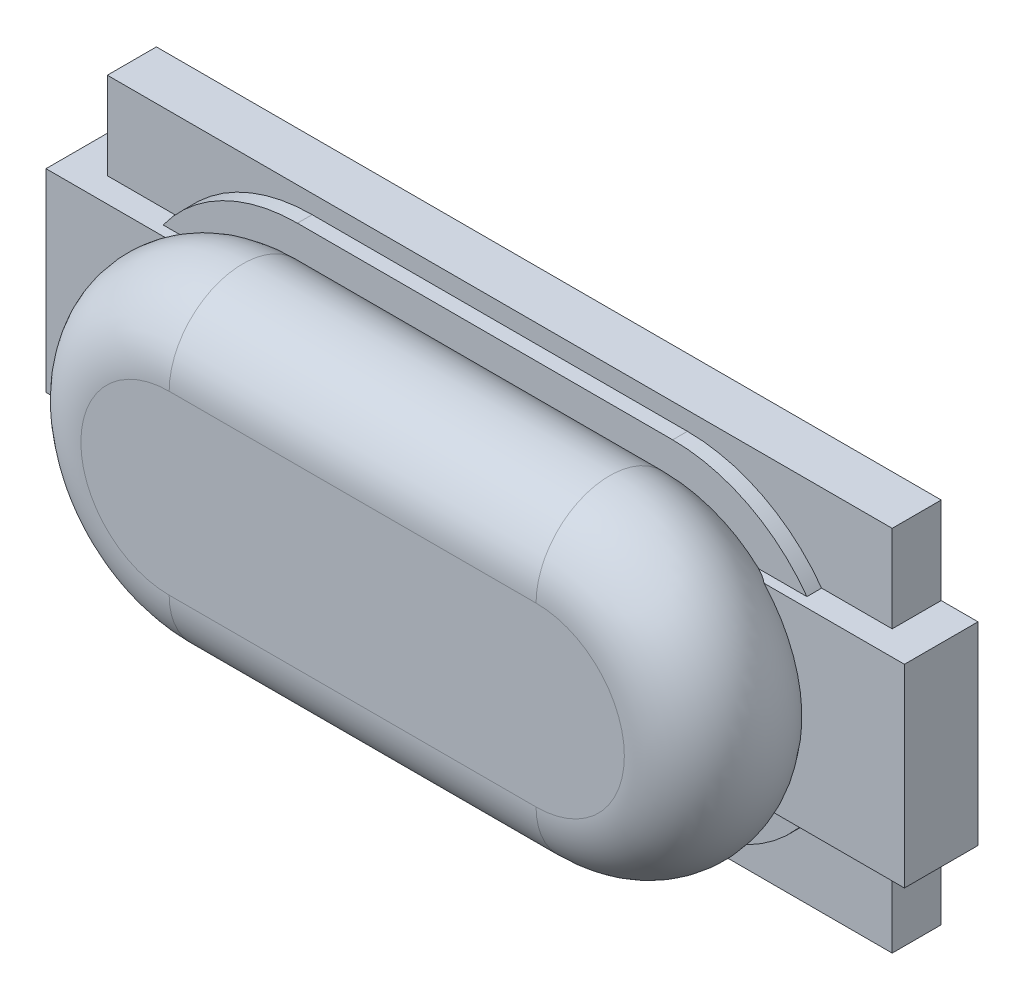
ISO-10303-21;
HEADER;
FILE_DESCRIPTION(('STEP AP214'),'2;1');
FILE_NAME('part.step','',(''),(''),'','','');
FILE_SCHEMA(('AUTOMOTIVE_DESIGN { 1 0 10303 214 1 1 1 1 }'));
ENDSEC;
DATA;
#1=APPLICATION_CONTEXT('core data for automotive mechanical design processes');
#2=APPLICATION_PROTOCOL_DEFINITION('international standard','automotive_design',2000,#1);
#3=PRODUCT_CONTEXT('',#1,'mechanical');
#4=PRODUCT('Part','Part','',(#3));
#5=PRODUCT_RELATED_PRODUCT_CATEGORY('part','',(#4));
#6=PRODUCT_DEFINITION_FORMATION('','',#4);
#7=PRODUCT_DEFINITION_CONTEXT('part definition',#1,'design');
#8=PRODUCT_DEFINITION('design','',#6,#7);
#9=PRODUCT_DEFINITION_SHAPE('','',#8);
#10=(LENGTH_UNIT() NAMED_UNIT(*) SI_UNIT(.MILLI.,.METRE.));
#11=(NAMED_UNIT(*) PLANE_ANGLE_UNIT() SI_UNIT($,.RADIAN.));
#12=(NAMED_UNIT(*) SI_UNIT($,.STERADIAN.) SOLID_ANGLE_UNIT());
#13=UNCERTAINTY_MEASURE_WITH_UNIT(LENGTH_MEASURE(1.E-05),#10,'distance_accuracy_value','');
#14=(GEOMETRIC_REPRESENTATION_CONTEXT(3) GLOBAL_UNCERTAINTY_ASSIGNED_CONTEXT((#13)) GLOBAL_UNIT_ASSIGNED_CONTEXT((#10,
#11,#12)) REPRESENTATION_CONTEXT('',''));
#15=CARTESIAN_POINT('',(0.,0.,0.));
#16=DIRECTION('',(0.,0.,1.));
#17=DIRECTION('',(1.,0.,0.));
#18=AXIS2_PLACEMENT_3D('',#15,#16,#17);
#19=CARTESIAN_POINT('',(0.,0.36,0.5));
#20=DIRECTION('',(-1.,0.,0.));
#21=DIRECTION('',(0.,0.,1.));
#22=AXIS2_PLACEMENT_3D('',#19,#20,#21);
#23=CYLINDRICAL_SURFACE('',#22,0.3);
#24=DIRECTION('',(1.,0.,0.));
#25=VECTOR('',#24,1.);
#26=CARTESIAN_POINT('',(-0.748,0.36,0.8));
#27=LINE('',#26,#25);
#28=CARTESIAN_POINT('',(0.748,0.36,0.8));
#29=VERTEX_POINT('',#28);
#30=CARTESIAN_POINT('',(-0.748,0.36,0.8));
#31=VERTEX_POINT('',#30);
#32=EDGE_CURVE('E333',#29,#31,#27,.F.);
#33=ORIENTED_EDGE('',*,*,#32,.F.);
#34=CARTESIAN_POINT('',(0.748,0.36,0.5));
#35=DIRECTION('',(-1.,0.,0.));
#36=DIRECTION('',(0.,0.,1.));
#37=AXIS2_PLACEMENT_3D('',#34,#35,#36);
#38=CIRCLE('',#37,0.3);
#39=CARTESIAN_POINT('',(0.748,0.54,0.26));
#40=VERTEX_POINT('',#39);
#41=EDGE_CURVE('E198',#29,#40,#38,.T.);
#42=ORIENTED_EDGE('',*,*,#41,.T.);
#43=DIRECTION('',(1.,0.,0.));
#44=VECTOR('',#43,1.);
#45=CARTESIAN_POINT('',(-0.765,0.54,0.26));
#46=LINE('',#45,#44);
#47=CARTESIAN_POINT('',(-0.748,0.54,0.26));
#48=VERTEX_POINT('',#47);
#49=EDGE_CURVE('E229',#48,#40,#46,.T.);
#50=ORIENTED_EDGE('',*,*,#49,.F.);
#51=CARTESIAN_POINT('',(-0.748,0.36,0.5));
#52=DIRECTION('',(-1.,0.,0.));
#53=DIRECTION('',(0.,0.,1.));
#54=AXIS2_PLACEMENT_3D('',#51,#52,#53);
#55=CIRCLE('',#54,0.3);
#56=EDGE_CURVE('E655',#48,#31,#55,.F.);
#57=ORIENTED_EDGE('',*,*,#56,.T.);
#58=EDGE_LOOP('',(#33,#42,#50,#57));
#59=FACE_BOUND('',#58,.T.);
#60=ADVANCED_FACE('F16',(#59),#23,.T.);
#61=CARTESIAN_POINT('',(-0.748,-0.36,0.5));
#62=DIRECTION('',(1.,0.,0.));
#63=DIRECTION('',(0.,0.,-1.));
#64=AXIS2_PLACEMENT_3D('',#61,#62,#63);
#65=CYLINDRICAL_SURFACE('',#64,0.3);
#66=DIRECTION('',(1.,0.,0.));
#67=VECTOR('',#66,1.);
#68=CARTESIAN_POINT('',(-0.748,-0.36,0.8));
#69=LINE('',#68,#67);
#70=CARTESIAN_POINT('',(-0.748,-0.36,0.8));
#71=VERTEX_POINT('',#70);
#72=CARTESIAN_POINT('',(0.748,-0.36,0.8));
#73=VERTEX_POINT('',#72);
#74=EDGE_CURVE('E304',#71,#73,#69,.T.);
#75=ORIENTED_EDGE('',*,*,#74,.F.);
#76=CARTESIAN_POINT('',(-0.748,-0.36,0.5));
#77=DIRECTION('',(1.,0.,0.));
#78=DIRECTION('',(0.,0.,-1.));
#79=AXIS2_PLACEMENT_3D('',#76,#77,#78);
#80=CIRCLE('',#79,0.3);
#81=CARTESIAN_POINT('',(-0.748,-0.54,0.26));
#82=VERTEX_POINT('',#81);
#83=EDGE_CURVE('E232',#71,#82,#80,.T.);
#84=ORIENTED_EDGE('',*,*,#83,.T.);
#85=DIRECTION('',(1.,0.,0.));
#86=VECTOR('',#85,1.);
#87=CARTESIAN_POINT('',(-0.765,-0.54,0.26));
#88=LINE('',#87,#86);
#89=CARTESIAN_POINT('',(0.748,-0.54,0.26));
#90=VERTEX_POINT('',#89);
#91=EDGE_CURVE('E294',#90,#82,#88,.F.);
#92=ORIENTED_EDGE('',*,*,#91,.F.);
#93=CARTESIAN_POINT('',(0.748,-0.36,0.5));
#94=DIRECTION('',(1.,0.,0.));
#95=DIRECTION('',(0.,0.,-1.));
#96=AXIS2_PLACEMENT_3D('',#93,#94,#95);
#97=CIRCLE('',#96,0.3);
#98=EDGE_CURVE('E245',#90,#73,#97,.F.);
#99=ORIENTED_EDGE('',*,*,#98,.T.);
#100=EDGE_LOOP('',(#75,#84,#92,#99));
#101=FACE_BOUND('',#100,.T.);
#102=ADVANCED_FACE('F665',(#101),#65,.T.);
#103=CARTESIAN_POINT('',(-0.765,-0.675,0.26));
#104=DIRECTION('',(0.,0.,1.));
#105=DIRECTION('',(1.,0.,0.));
#106=AXIS2_PLACEMENT_3D('',#103,#104,#105);
#107=PLANE('',#106);
#108=DIRECTION('',(1.,0.,0.));
#109=VECTOR('',#108,1.);
#110=CARTESIAN_POINT('',(0.765,0.675,0.26));
#111=LINE('',#110,#109);
#112=CARTESIAN_POINT('',(-0.765,0.675,0.26));
#113=VERTEX_POINT('',#112);
#114=CARTESIAN_POINT('',(0.765,0.675,0.26));
#115=VERTEX_POINT('',#114);
#116=EDGE_CURVE('E345',#113,#115,#111,.T.);
#117=ORIENTED_EDGE('',*,*,#116,.F.);
#118=CARTESIAN_POINT('',(-0.765,0.,0.26));
#119=DIRECTION('',(0.,0.,1.));
#120=DIRECTION('',(1.,0.,0.));
#121=AXIS2_PLACEMENT_3D('',#118,#119,#120);
#122=CIRCLE('',#121,0.675);
#123=CARTESIAN_POINT('',(-1.31235728733616,0.395,0.26));
#124=VERTEX_POINT('',#123);
#125=EDGE_CURVE('E411',#124,#113,#122,.F.);
#126=ORIENTED_EDGE('',*,*,#125,.F.);
#127=DIRECTION('',(1.,0.,0.));
#128=VECTOR('',#127,1.);
#129=CARTESIAN_POINT('',(-0.765,0.395,0.26));
#130=LINE('',#129,#128);
#131=CARTESIAN_POINT('',(-1.11620510588529,0.395,0.26));
#132=VERTEX_POINT('',#131);
#133=EDGE_CURVE('E230',#124,#132,#130,.T.);
#134=ORIENTED_EDGE('',*,*,#133,.T.);
#135=CARTESIAN_POINT('',(-0.748,0.,0.26));
#136=DIRECTION('',(0.,0.,1.));
#137=DIRECTION('',(1.,0.,0.));
#138=AXIS2_PLACEMENT_3D('',#135,#136,#137);
#139=CIRCLE('',#138,0.54);
#140=EDGE_CURVE('E437',#48,#132,#139,.T.);
#141=ORIENTED_EDGE('',*,*,#140,.F.);
#142=ORIENTED_EDGE('',*,*,#49,.T.);
#143=CARTESIAN_POINT('',(0.748,0.,0.26));
#144=DIRECTION('',(0.,0.,1.));
#145=DIRECTION('',(1.,0.,0.));
#146=AXIS2_PLACEMENT_3D('',#143,#144,#145);
#147=CIRCLE('',#146,0.54);
#148=CARTESIAN_POINT('',(1.11620510588529,0.395,0.26));
#149=VERTEX_POINT('',#148);
#150=EDGE_CURVE('E19',#40,#149,#147,.F.);
#151=ORIENTED_EDGE('',*,*,#150,.T.);
#152=DIRECTION('',(1.,0.,0.));
#153=VECTOR('',#152,1.);
#154=CARTESIAN_POINT('',(-0.765,0.395,0.26));
#155=LINE('',#154,#153);
#156=CARTESIAN_POINT('',(1.31235728733616,0.395,0.26));
#157=VERTEX_POINT('',#156);
#158=EDGE_CURVE('E205',#149,#157,#155,.T.);
#159=ORIENTED_EDGE('',*,*,#158,.T.);
#160=CARTESIAN_POINT('',(0.765,0.,0.26));
#161=DIRECTION('',(0.,0.,1.));
#162=DIRECTION('',(1.,0.,0.));
#163=AXIS2_PLACEMENT_3D('',#160,#161,#162);
#164=CIRCLE('',#163,0.675);
#165=EDGE_CURVE('E215',#157,#115,#164,.T.);
#166=ORIENTED_EDGE('',*,*,#165,.T.);
#167=EDGE_LOOP('',(#117,#126,#134,#141,#142,#151,#159,#166));
#168=FACE_BOUND('',#167,.T.);
#169=ADVANCED_FACE('F227',(#168),#107,.T.);
#170=CARTESIAN_POINT('',(-0.748,-0.66,0.8));
#171=DIRECTION('',(0.,0.,1.));
#172=DIRECTION('',(1.,0.,0.));
#173=AXIS2_PLACEMENT_3D('',#170,#171,#172);
#174=PLANE('',#173);
#175=ORIENTED_EDGE('',*,*,#74,.T.);
#176=CARTESIAN_POINT('',(0.748,0.,0.8));
#177=DIRECTION('',(0.,0.,-1.));
#178=DIRECTION('',(0.,1.,0.));
#179=AXIS2_PLACEMENT_3D('',#176,#177,#178);
#180=CIRCLE('',#179,0.36);
#181=EDGE_CURVE('E341',#29,#73,#180,.T.);
#182=ORIENTED_EDGE('',*,*,#181,.F.);
#183=ORIENTED_EDGE('',*,*,#32,.T.);
#184=CARTESIAN_POINT('',(-0.748,0.,0.8));
#185=DIRECTION('',(0.,0.,-1.));
#186=DIRECTION('',(0.,-1.,0.));
#187=AXIS2_PLACEMENT_3D('',#184,#185,#186);
#188=CIRCLE('',#187,0.36);
#189=EDGE_CURVE('E240',#71,#31,#188,.T.);
#190=ORIENTED_EDGE('',*,*,#189,.F.);
#191=EDGE_LOOP('',(#175,#182,#183,#190));
#192=FACE_BOUND('',#191,.T.);
#193=ADVANCED_FACE('F314',(#192),#174,.T.);
#194=CARTESIAN_POINT('',(-0.765,-0.675,0.26));
#195=DIRECTION('',(0.,0.,1.));
#196=DIRECTION('',(1.,0.,0.));
#197=AXIS2_PLACEMENT_3D('',#194,#195,#196);
#198=PLANE('',#197);
#199=ORIENTED_EDGE('',*,*,#91,.T.);
#200=CARTESIAN_POINT('',(-0.748,0.,0.26));
#201=DIRECTION('',(0.,0.,1.));
#202=DIRECTION('',(1.,0.,0.));
#203=AXIS2_PLACEMENT_3D('',#200,#201,#202);
#204=CIRCLE('',#203,0.54);
#205=CARTESIAN_POINT('',(-1.11620510588529,-0.395,0.26));
#206=VERTEX_POINT('',#205);
#207=EDGE_CURVE('E297',#206,#82,#204,.T.);
#208=ORIENTED_EDGE('',*,*,#207,.F.);
#209=DIRECTION('',(1.,0.,0.));
#210=VECTOR('',#209,1.);
#211=CARTESIAN_POINT('',(-0.765,-0.395,0.26));
#212=LINE('',#211,#210);
#213=CARTESIAN_POINT('',(-1.31235728733616,-0.395,0.26));
#214=VERTEX_POINT('',#213);
#215=EDGE_CURVE('E301',#206,#214,#212,.F.);
#216=ORIENTED_EDGE('',*,*,#215,.T.);
#217=CARTESIAN_POINT('',(-0.765,0.,0.26));
#218=DIRECTION('',(0.,0.,1.));
#219=DIRECTION('',(1.,0.,0.));
#220=AXIS2_PLACEMENT_3D('',#217,#218,#219);
#221=CIRCLE('',#220,0.675);
#222=CARTESIAN_POINT('',(-0.765,-0.675,0.26));
#223=VERTEX_POINT('',#222);
#224=EDGE_CURVE('E300',#214,#223,#221,.T.);
#225=ORIENTED_EDGE('',*,*,#224,.T.);
#226=DIRECTION('',(1.,0.,0.));
#227=VECTOR('',#226,1.);
#228=CARTESIAN_POINT('',(-0.765,-0.675,0.26));
#229=LINE('',#228,#227);
#230=CARTESIAN_POINT('',(0.765,-0.675,0.26));
#231=VERTEX_POINT('',#230);
#232=EDGE_CURVE('E289',#231,#223,#229,.F.);
#233=ORIENTED_EDGE('',*,*,#232,.F.);
#234=CARTESIAN_POINT('',(0.765,0.,0.26));
#235=DIRECTION('',(0.,0.,1.));
#236=DIRECTION('',(1.,0.,0.));
#237=AXIS2_PLACEMENT_3D('',#234,#235,#236);
#238=CIRCLE('',#237,0.675);
#239=CARTESIAN_POINT('',(1.31235728733616,-0.395,0.26));
#240=VERTEX_POINT('',#239);
#241=EDGE_CURVE('E489',#240,#231,#238,.F.);
#242=ORIENTED_EDGE('',*,*,#241,.F.);
#243=DIRECTION('',(1.,0.,0.));
#244=VECTOR('',#243,1.);
#245=CARTESIAN_POINT('',(-0.765,-0.395,0.26));
#246=LINE('',#245,#244);
#247=CARTESIAN_POINT('',(1.11620510588529,-0.395,0.26));
#248=VERTEX_POINT('',#247);
#249=EDGE_CURVE('E298',#240,#248,#246,.F.);
#250=ORIENTED_EDGE('',*,*,#249,.T.);
#251=CARTESIAN_POINT('',(0.748,0.,0.26));
#252=DIRECTION('',(0.,0.,1.));
#253=DIRECTION('',(1.,0.,0.));
#254=AXIS2_PLACEMENT_3D('',#251,#252,#253);
#255=CIRCLE('',#254,0.54);
#256=EDGE_CURVE('E636',#90,#248,#255,.T.);
#257=ORIENTED_EDGE('',*,*,#256,.F.);
#258=EDGE_LOOP('',(#199,#208,#216,#225,#233,#242,#250,#257));
#259=FACE_BOUND('',#258,.T.);
#260=ADVANCED_FACE('F259',(#259),#198,.T.);
#261=CARTESIAN_POINT('',(-0.748,0.,0.5));
#262=DIRECTION('',(0.,0.,1.));
#263=DIRECTION('',(-1.,0.,0.));
#264=AXIS2_PLACEMENT_3D('',#261,#262,#263);
#265=TOROIDAL_SURFACE('',#264,0.36,0.3);
#266=ORIENTED_EDGE('',*,*,#56,.F.);
#267=ORIENTED_EDGE('',*,*,#140,.T.);
#268=CARTESIAN_POINT('',(-1.17773975167522,0.395,0.3001));
#269=CARTESIAN_POINT('',(-1.17299925239635,0.395,0.296194068107284));
#270=CARTESIAN_POINT('',(-1.16814360275164,0.395,0.292429365508522));
#271=CARTESIAN_POINT('',(-1.15824113131823,0.395,0.285191667015459));
#272=CARTESIAN_POINT('',(-1.15319490914168,0.395,0.281717851451327));
#273=CARTESIAN_POINT('',(-1.14292280202309,0.395,0.275048612592429));
#274=CARTESIAN_POINT('',(-1.13769692948187,0.395,0.271853170135846));
#275=CARTESIAN_POINT('',(-1.12707203991182,0.395,0.265726365794871));
#276=CARTESIAN_POINT('',(-1.12167256058991,0.395,0.262795804788212));
#277=CARTESIAN_POINT('',(-1.11620510588529,0.395,0.259999999999999));
#278=B_SPLINE_CURVE_WITH_KNOTS('',3,(#268,#269,#270,#271,#272,#273,#274,#275,#276,#277),
.UNSPECIFIED.,.F.,.F.,(4,2,2,2,4),(0.,0.0184230566428002,0.0367923189429483,0.0551603157938781,
0.0735821106827577),.UNSPECIFIED.);
#279=CARTESIAN_POINT('',(-1.17773975167522,0.395,0.3001));
#280=VERTEX_POINT('',#279);
#281=EDGE_CURVE('E413',#280,#132,#278,.T.);
#282=ORIENTED_EDGE('',*,*,#281,.F.);
#283=CARTESIAN_POINT('',(-0.748,0.,0.3001));
#284=DIRECTION('',(0.,0.,1.));
#285=DIRECTION('',(1.,0.,0.));
#286=AXIS2_PLACEMENT_3D('',#283,#284,#285);
#287=CIRCLE('',#286,0.583696200235945);
#288=CARTESIAN_POINT('',(-1.17773975167522,-0.395,0.3001));
#289=VERTEX_POINT('',#288);
#290=EDGE_CURVE('E431',#289,#280,#287,.F.);
#291=ORIENTED_EDGE('',*,*,#290,.F.);
#292=CARTESIAN_POINT('',(-1.11620510588529,-0.395,0.259999999999999));
#293=CARTESIAN_POINT('',(-1.12167256058991,-0.395,0.262795804788212));
#294=CARTESIAN_POINT('',(-1.12707203991181,-0.395,0.265726365794871));
#295=CARTESIAN_POINT('',(-1.13769692948187,-0.395,0.271853170135846));
#296=CARTESIAN_POINT('',(-1.14292280202309,-0.395,0.275048612592429));
#297=CARTESIAN_POINT('',(-1.15319490914168,-0.395,0.281717851451327));
#298=CARTESIAN_POINT('',(-1.15824113131823,-0.395,0.285191667015459));
#299=CARTESIAN_POINT('',(-1.16814360275164,-0.395,0.292429365508522));
#300=CARTESIAN_POINT('',(-1.17299925239635,-0.395,0.296194068107284));
#301=CARTESIAN_POINT('',(-1.17773975167522,-0.395,0.3001));
#302=B_SPLINE_CURVE_WITH_KNOTS('',3,(#292,#293,#294,#295,#296,#297,#298,#299,#300,#301),
.UNSPECIFIED.,.F.,.F.,(4,2,2,2,4),(0.,0.0184217948888799,0.0367897917398098,0.055159054039958,
0.0735821106827585),.UNSPECIFIED.);
#303=EDGE_CURVE('E479',#206,#289,#302,.T.);
#304=ORIENTED_EDGE('',*,*,#303,.F.);
#305=ORIENTED_EDGE('',*,*,#207,.T.);
#306=ORIENTED_EDGE('',*,*,#83,.F.);
#307=ORIENTED_EDGE('',*,*,#189,.T.);
#308=EDGE_LOOP('',(#266,#267,#282,#291,#304,#305,#306,#307));
#309=FACE_BOUND('',#308,.T.);
#310=ADVANCED_FACE('F247',(#309),#265,.T.);
#311=CARTESIAN_POINT('',(0.25,-0.395,0.3001));
#312=DIRECTION('',(0.,0.,1.));
#313=DIRECTION('',(1.,0.,0.));
#314=AXIS2_PLACEMENT_3D('',#311,#312,#313);
#315=PLANE('',#314);
#316=DIRECTION('',(0.,1.,0.));
#317=VECTOR('',#316,1.);
#318=CARTESIAN_POINT('',(-1.75,0.395,0.3001));
#319=LINE('',#318,#317);
#320=CARTESIAN_POINT('',(-1.75,-0.395,0.3001));
#321=VERTEX_POINT('',#320);
#322=CARTESIAN_POINT('',(-1.75,0.395,0.3001));
#323=VERTEX_POINT('',#322);
#324=EDGE_CURVE('E430',#321,#323,#319,.T.);
#325=ORIENTED_EDGE('',*,*,#324,.F.);
#326=DIRECTION('',(1.,0.,0.));
#327=VECTOR('',#326,1.);
#328=CARTESIAN_POINT('',(-1.75,-0.395,0.3001));
#329=LINE('',#328,#327);
#330=EDGE_CURVE('E428',#289,#321,#329,.F.);
#331=ORIENTED_EDGE('',*,*,#330,.F.);
#332=ORIENTED_EDGE('',*,*,#290,.T.);
#333=DIRECTION('',(1.,0.,0.));
#334=VECTOR('',#333,1.);
#335=CARTESIAN_POINT('',(0.25,0.395,0.3001));
#336=LINE('',#335,#334);
#337=EDGE_CURVE('E273',#323,#280,#336,.T.);
#338=ORIENTED_EDGE('',*,*,#337,.F.);
#339=EDGE_LOOP('',(#325,#331,#332,#338));
#340=FACE_BOUND('',#339,.T.);
#341=ADVANCED_FACE('F258',(#340),#315,.T.);
#342=CARTESIAN_POINT('',(-1.75,0.395,0.000100000000000031));
#343=DIRECTION('',(-1.,0.,0.));
#344=DIRECTION('',(0.,0.,1.));
#345=AXIS2_PLACEMENT_3D('',#342,#343,#344);
#346=PLANE('',#345);
#347=ORIENTED_EDGE('',*,*,#324,.T.);
#348=DIRECTION('',(0.,0.,1.));
#349=VECTOR('',#348,1.);
#350=CARTESIAN_POINT('',(-1.75,0.395,0.000100000000000031));
#351=LINE('',#350,#349);
#352=CARTESIAN_POINT('',(-1.75,0.395,0.000100000000000031));
#353=VERTEX_POINT('',#352);
#354=EDGE_CURVE('E270',#353,#323,#351,.T.);
#355=ORIENTED_EDGE('',*,*,#354,.F.);
#356=DIRECTION('',(0.,1.,0.));
#357=VECTOR('',#356,1.);
#358=CARTESIAN_POINT('',(-1.75,-0.395,0.000100000000000031));
#359=LINE('',#358,#357);
#360=CARTESIAN_POINT('',(-1.75,-0.395,0.000100000000000031));
#361=VERTEX_POINT('',#360);
#362=EDGE_CURVE('E281',#361,#353,#359,.T.);
#363=ORIENTED_EDGE('',*,*,#362,.F.);
#364=DIRECTION('',(0.,0.,-1.));
#365=VECTOR('',#364,1.);
#366=CARTESIAN_POINT('',(-1.75,-0.395,0.000100000000000031));
#367=LINE('',#366,#365);
#368=EDGE_CURVE('E425',#321,#361,#367,.T.);
#369=ORIENTED_EDGE('',*,*,#368,.F.);
#370=EDGE_LOOP('',(#347,#355,#363,#369));
#371=FACE_BOUND('',#370,.T.);
#372=ADVANCED_FACE('F669',(#371),#346,.T.);
#373=CARTESIAN_POINT('',(-0.765,0.,0.2));
#374=DIRECTION('',(0.,0.,1.));
#375=DIRECTION('',(1.,0.,0.));
#376=AXIS2_PLACEMENT_3D('',#373,#374,#375);
#377=CYLINDRICAL_SURFACE('',#376,0.675);
#378=DIRECTION('',(0.,0.,1.));
#379=VECTOR('',#378,1.);
#380=CARTESIAN_POINT('',(-0.765,0.675,0.2));
#381=LINE('',#380,#379);
#382=CARTESIAN_POINT('',(-0.765,0.675,0.2));
#383=VERTEX_POINT('',#382);
#384=EDGE_CURVE('E408',#383,#113,#381,.T.);
#385=ORIENTED_EDGE('',*,*,#384,.F.);
#386=CARTESIAN_POINT('',(-0.765,0.,0.2));
#387=DIRECTION('',(0.,0.,1.));
#388=DIRECTION('',(1.,0.,0.));
#389=AXIS2_PLACEMENT_3D('',#386,#387,#388);
#390=CIRCLE('',#389,0.675);
#391=CARTESIAN_POINT('',(-1.31235728733616,0.395,0.2));
#392=VERTEX_POINT('',#391);
#393=EDGE_CURVE('E465',#392,#383,#390,.F.);
#394=ORIENTED_EDGE('',*,*,#393,.F.);
#395=DIRECTION('',(0.,0.,1.));
#396=VECTOR('',#395,1.);
#397=CARTESIAN_POINT('',(-1.31235728733616,0.395,0.000100000000000031));
#398=LINE('',#397,#396);
#399=EDGE_CURVE('E274',#124,#392,#398,.F.);
#400=ORIENTED_EDGE('',*,*,#399,.F.);
#401=ORIENTED_EDGE('',*,*,#125,.T.);
#402=EDGE_LOOP('',(#385,#394,#400,#401));
#403=FACE_BOUND('',#402,.T.);
#404=ADVANCED_FACE('F690',(#403),#377,.T.);
#405=CARTESIAN_POINT('',(0.765,0.675,0.2));
#406=DIRECTION('',(0.,1.,0.));
#407=DIRECTION('',(0.,0.,1.));
#408=AXIS2_PLACEMENT_3D('',#405,#406,#407);
#409=PLANE('',#408);
#410=ORIENTED_EDGE('',*,*,#116,.T.);
#411=DIRECTION('',(0.,0.,1.));
#412=VECTOR('',#411,1.);
#413=CARTESIAN_POINT('',(0.765,0.675,0.2));
#414=LINE('',#413,#412);
#415=CARTESIAN_POINT('',(0.765,0.675,0.2));
#416=VERTEX_POINT('',#415);
#417=EDGE_CURVE('E405',#416,#115,#414,.T.);
#418=ORIENTED_EDGE('',*,*,#417,.F.);
#419=DIRECTION('',(1.,0.,0.));
#420=VECTOR('',#419,1.);
#421=CARTESIAN_POINT('',(-1.6,0.675,0.2));
#422=LINE('',#421,#420);
#423=EDGE_CURVE('E458',#383,#416,#422,.T.);
#424=ORIENTED_EDGE('',*,*,#423,.F.);
#425=ORIENTED_EDGE('',*,*,#384,.T.);
#426=EDGE_LOOP('',(#410,#418,#424,#425));
#427=FACE_BOUND('',#426,.T.);
#428=ADVANCED_FACE('F452',(#427),#409,.T.);
#429=CARTESIAN_POINT('',(0.765,0.,0.2));
#430=DIRECTION('',(0.,0.,1.));
#431=DIRECTION('',(1.,0.,0.));
#432=AXIS2_PLACEMENT_3D('',#429,#430,#431);
#433=CYLINDRICAL_SURFACE('',#432,0.675);
#434=ORIENTED_EDGE('',*,*,#417,.T.);
#435=ORIENTED_EDGE('',*,*,#165,.F.);
#436=DIRECTION('',(0.,0.,1.));
#437=VECTOR('',#436,1.);
#438=CARTESIAN_POINT('',(1.31235728733616,0.395,0.000100000000000031));
#439=LINE('',#438,#437);
#440=CARTESIAN_POINT('',(1.31235728733616,0.395,0.2));
#441=VERTEX_POINT('',#440);
#442=EDGE_CURVE('E212',#441,#157,#439,.T.);
#443=ORIENTED_EDGE('',*,*,#442,.F.);
#444=CARTESIAN_POINT('',(0.765,0.,0.2));
#445=DIRECTION('',(0.,0.,1.));
#446=DIRECTION('',(1.,0.,0.));
#447=AXIS2_PLACEMENT_3D('',#444,#445,#446);
#448=CIRCLE('',#447,0.675);
#449=EDGE_CURVE('E391',#416,#441,#448,.F.);
#450=ORIENTED_EDGE('',*,*,#449,.F.);
#451=EDGE_LOOP('',(#434,#435,#443,#450));
#452=FACE_BOUND('',#451,.T.);
#453=ADVANCED_FACE('F357',(#452),#433,.T.);
#454=CARTESIAN_POINT('',(0.748,0.,0.5));
#455=DIRECTION('',(0.,0.,1.));
#456=DIRECTION('',(1.,0.,0.));
#457=AXIS2_PLACEMENT_3D('',#454,#455,#456);
#458=TOROIDAL_SURFACE('',#457,0.36,0.3);
#459=CARTESIAN_POINT('',(1.17773975167522,-0.395,0.3001));
#460=CARTESIAN_POINT('',(1.17299925239635,-0.395,0.296194068107284));
#461=CARTESIAN_POINT('',(1.16814360275165,-0.395,0.292429365508522));
#462=CARTESIAN_POINT('',(1.15824113131823,-0.395,0.285191667015459));
#463=CARTESIAN_POINT('',(1.15319490914168,-0.395,0.281717851451327));
#464=CARTESIAN_POINT('',(1.14292280202309,-0.395,0.275048612592429));
#465=CARTESIAN_POINT('',(1.13769692948187,-0.395,0.271853170135846));
#466=CARTESIAN_POINT('',(1.12707203991182,-0.395,0.265726365794871));
#467=CARTESIAN_POINT('',(1.12167256058991,-0.395,0.262795804788212));
#468=CARTESIAN_POINT('',(1.11620510588529,-0.395,0.259999999999999));
#469=B_SPLINE_CURVE_WITH_KNOTS('',3,(#459,#460,#461,#462,#463,#464,#465,#466,#467,#468),
.UNSPECIFIED.,.F.,.F.,(4,2,2,2,4),(0.,0.0184230566428005,0.0367923189429486,0.0551603157938784,
0.073582110682758),.UNSPECIFIED.);
#470=CARTESIAN_POINT('',(1.17773975167522,-0.395,0.3001));
#471=VERTEX_POINT('',#470);
#472=EDGE_CURVE('E493',#471,#248,#469,.T.);
#473=ORIENTED_EDGE('',*,*,#472,.F.);
#474=CARTESIAN_POINT('',(0.748,0.,0.3001));
#475=DIRECTION('',(0.,0.,1.));
#476=DIRECTION('',(1.,0.,0.));
#477=AXIS2_PLACEMENT_3D('',#474,#475,#476);
#478=CIRCLE('',#477,0.583696200235945);
#479=CARTESIAN_POINT('',(1.17773975167522,0.395,0.3001));
#480=VERTEX_POINT('',#479);
#481=EDGE_CURVE('E221',#480,#471,#478,.F.);
#482=ORIENTED_EDGE('',*,*,#481,.F.);
#483=CARTESIAN_POINT('',(1.11620510588529,0.395,0.259999999999999));
#484=CARTESIAN_POINT('',(1.12167256058991,0.395,0.262795804788212));
#485=CARTESIAN_POINT('',(1.12707203991182,0.395,0.265726365794871));
#486=CARTESIAN_POINT('',(1.13769692948187,0.395,0.271853170135846));
#487=CARTESIAN_POINT('',(1.14292280202309,0.395,0.275048612592429));
#488=CARTESIAN_POINT('',(1.15319490914168,0.395,0.281717851451327));
#489=CARTESIAN_POINT('',(1.15824113131823,0.395,0.285191667015459));
#490=CARTESIAN_POINT('',(1.16814360275164,0.395,0.292429365508523));
#491=CARTESIAN_POINT('',(1.17299925239635,0.395,0.296194068107284));
#492=CARTESIAN_POINT('',(1.17773975167522,0.395,0.3001));
#493=B_SPLINE_CURVE_WITH_KNOTS('',3,(#483,#484,#485,#486,#487,#488,#489,#490,#491,#492),
.UNSPECIFIED.,.F.,.F.,(4,2,2,2,4),(0.,0.0184217948888798,0.0367897917398096,0.0551590540399575,
0.0735821106827578),.UNSPECIFIED.);
#494=EDGE_CURVE('E209',#149,#480,#493,.T.);
#495=ORIENTED_EDGE('',*,*,#494,.F.);
#496=ORIENTED_EDGE('',*,*,#150,.F.);
#497=ORIENTED_EDGE('',*,*,#41,.F.);
#498=ORIENTED_EDGE('',*,*,#181,.T.);
#499=ORIENTED_EDGE('',*,*,#98,.F.);
#500=ORIENTED_EDGE('',*,*,#256,.T.);
#501=EDGE_LOOP('',(#473,#482,#495,#496,#497,#498,#499,#500));
#502=FACE_BOUND('',#501,.T.);
#503=ADVANCED_FACE('F218',(#502),#458,.T.);
#504=CARTESIAN_POINT('',(1.75,-0.395,0.000100000000000031));
#505=DIRECTION('',(1.,0.,0.));
#506=DIRECTION('',(0.,0.,-1.));
#507=AXIS2_PLACEMENT_3D('',#504,#505,#506);
#508=PLANE('',#507);
#509=DIRECTION('',(0.,1.,0.));
#510=VECTOR('',#509,1.);
#511=CARTESIAN_POINT('',(1.75,-0.395,0.3001));
#512=LINE('',#511,#510);
#513=CARTESIAN_POINT('',(1.75,-0.395,0.3001));
#514=VERTEX_POINT('',#513);
#515=CARTESIAN_POINT('',(1.75,0.395,0.3001));
#516=VERTEX_POINT('',#515);
#517=EDGE_CURVE('E514',#514,#516,#512,.T.);
#518=ORIENTED_EDGE('',*,*,#517,.F.);
#519=DIRECTION('',(0.,0.,-1.));
#520=VECTOR('',#519,1.);
#521=CARTESIAN_POINT('',(1.75,-0.395,0.000100000000000031));
#522=LINE('',#521,#520);
#523=CARTESIAN_POINT('',(1.75,-0.395,0.000100000000000031));
#524=VERTEX_POINT('',#523);
#525=EDGE_CURVE('E518',#524,#514,#522,.F.);
#526=ORIENTED_EDGE('',*,*,#525,.F.);
#527=DIRECTION('',(0.,1.,0.));
#528=VECTOR('',#527,1.);
#529=CARTESIAN_POINT('',(1.75,-0.395,0.000100000000000031));
#530=LINE('',#529,#528);
#531=CARTESIAN_POINT('',(1.75,0.395,0.000100000000000031));
#532=VERTEX_POINT('',#531);
#533=EDGE_CURVE('E371',#532,#524,#530,.F.);
#534=ORIENTED_EDGE('',*,*,#533,.F.);
#535=DIRECTION('',(0.,0.,1.));
#536=VECTOR('',#535,1.);
#537=CARTESIAN_POINT('',(1.75,0.395,0.000100000000000031));
#538=LINE('',#537,#536);
#539=EDGE_CURVE('E374',#516,#532,#538,.F.);
#540=ORIENTED_EDGE('',*,*,#539,.F.);
#541=EDGE_LOOP('',(#518,#526,#534,#540));
#542=FACE_BOUND('',#541,.T.);
#543=ADVANCED_FACE('F356',(#542),#508,.T.);
#544=CARTESIAN_POINT('',(1.75,-0.395,0.3001));
#545=DIRECTION('',(0.,0.,1.));
#546=DIRECTION('',(1.,0.,0.));
#547=AXIS2_PLACEMENT_3D('',#544,#545,#546);
#548=PLANE('',#547);
#549=ORIENTED_EDGE('',*,*,#517,.T.);
#550=DIRECTION('',(1.,0.,0.));
#551=VECTOR('',#550,1.);
#552=CARTESIAN_POINT('',(1.75,0.395,0.3001));
#553=LINE('',#552,#551);
#554=EDGE_CURVE('E223',#480,#516,#553,.T.);
#555=ORIENTED_EDGE('',*,*,#554,.F.);
#556=ORIENTED_EDGE('',*,*,#481,.T.);
#557=DIRECTION('',(1.,0.,0.));
#558=VECTOR('',#557,1.);
#559=CARTESIAN_POINT('',(-0.25,-0.395,0.3001));
#560=LINE('',#559,#558);
#561=EDGE_CURVE('E521',#514,#471,#560,.F.);
#562=ORIENTED_EDGE('',*,*,#561,.F.);
#563=EDGE_LOOP('',(#549,#555,#556,#562));
#564=FACE_BOUND('',#563,.T.);
#565=ADVANCED_FACE('F582',(#564),#548,.T.);
#566=CARTESIAN_POINT('',(0.765,0.,0.2));
#567=DIRECTION('',(0.,0.,1.));
#568=DIRECTION('',(1.,0.,0.));
#569=AXIS2_PLACEMENT_3D('',#566,#567,#568);
#570=CYLINDRICAL_SURFACE('',#569,0.675);
#571=DIRECTION('',(0.,0.,-1.));
#572=VECTOR('',#571,1.);
#573=CARTESIAN_POINT('',(0.765,-0.675,0.2));
#574=LINE('',#573,#572);
#575=CARTESIAN_POINT('',(0.765,-0.675,0.2));
#576=VERTEX_POINT('',#575);
#577=EDGE_CURVE('E293',#576,#231,#574,.F.);
#578=ORIENTED_EDGE('',*,*,#577,.F.);
#579=CARTESIAN_POINT('',(0.765,0.,0.2));
#580=DIRECTION('',(0.,0.,1.));
#581=DIRECTION('',(1.,0.,0.));
#582=AXIS2_PLACEMENT_3D('',#579,#580,#581);
#583=CIRCLE('',#582,0.675);
#584=CARTESIAN_POINT('',(1.31235728733616,-0.395,0.2));
#585=VERTEX_POINT('',#584);
#586=EDGE_CURVE('E548',#585,#576,#583,.F.);
#587=ORIENTED_EDGE('',*,*,#586,.F.);
#588=DIRECTION('',(0.,0.,-1.));
#589=VECTOR('',#588,1.);
#590=CARTESIAN_POINT('',(1.31235728733616,-0.395,0.000100000000000031));
#591=LINE('',#590,#589);
#592=EDGE_CURVE('E490',#240,#585,#591,.T.);
#593=ORIENTED_EDGE('',*,*,#592,.F.);
#594=ORIENTED_EDGE('',*,*,#241,.T.);
#595=EDGE_LOOP('',(#578,#587,#593,#594));
#596=FACE_BOUND('',#595,.T.);
#597=ADVANCED_FACE('F643',(#596),#570,.T.);
#598=CARTESIAN_POINT('',(-0.765,-0.675,0.2));
#599=DIRECTION('',(0.,-1.,0.));
#600=DIRECTION('',(0.,0.,-1.));
#601=AXIS2_PLACEMENT_3D('',#598,#599,#600);
#602=PLANE('',#601);
#603=ORIENTED_EDGE('',*,*,#232,.T.);
#604=DIRECTION('',(0.,0.,1.));
#605=VECTOR('',#604,1.);
#606=CARTESIAN_POINT('',(-0.765,-0.675,0.2));
#607=LINE('',#606,#605);
#608=CARTESIAN_POINT('',(-0.765,-0.675,0.2));
#609=VERTEX_POINT('',#608);
#610=EDGE_CURVE('E292',#609,#223,#607,.T.);
#611=ORIENTED_EDGE('',*,*,#610,.F.);
#612=DIRECTION('',(1.,0.,0.));
#613=VECTOR('',#612,1.);
#614=CARTESIAN_POINT('',(-1.6,-0.675,0.2));
#615=LINE('',#614,#613);
#616=EDGE_CURVE('E570',#576,#609,#615,.F.);
#617=ORIENTED_EDGE('',*,*,#616,.F.);
#618=ORIENTED_EDGE('',*,*,#577,.T.);
#619=EDGE_LOOP('',(#603,#611,#617,#618));
#620=FACE_BOUND('',#619,.T.);
#621=ADVANCED_FACE('F648',(#620),#602,.T.);
#622=CARTESIAN_POINT('',(-0.765,0.,0.2));
#623=DIRECTION('',(0.,0.,1.));
#624=DIRECTION('',(1.,0.,0.));
#625=AXIS2_PLACEMENT_3D('',#622,#623,#624);
#626=CYLINDRICAL_SURFACE('',#625,0.675);
#627=ORIENTED_EDGE('',*,*,#610,.T.);
#628=ORIENTED_EDGE('',*,*,#224,.F.);
#629=DIRECTION('',(0.,0.,-1.));
#630=VECTOR('',#629,1.);
#631=CARTESIAN_POINT('',(-1.31235728733616,-0.395,0.000100000000000031));
#632=LINE('',#631,#630);
#633=CARTESIAN_POINT('',(-1.31235728733616,-0.395,0.2));
#634=VERTEX_POINT('',#633);
#635=EDGE_CURVE('E427',#634,#214,#632,.F.);
#636=ORIENTED_EDGE('',*,*,#635,.F.);
#637=CARTESIAN_POINT('',(-0.765,0.,0.2));
#638=DIRECTION('',(0.,0.,1.));
#639=DIRECTION('',(1.,0.,0.));
#640=AXIS2_PLACEMENT_3D('',#637,#638,#639);
#641=CIRCLE('',#640,0.675);
#642=EDGE_CURVE('E422',#609,#634,#641,.F.);
#643=ORIENTED_EDGE('',*,*,#642,.F.);
#644=EDGE_LOOP('',(#627,#628,#636,#643));
#645=FACE_BOUND('',#644,.T.);
#646=ADVANCED_FACE('F650',(#645),#626,.T.);
#647=CARTESIAN_POINT('',(0.25,0.395,0.000100000000000031));
#648=DIRECTION('',(0.,1.,0.));
#649=DIRECTION('',(0.,0.,1.));
#650=AXIS2_PLACEMENT_3D('',#647,#648,#649);
#651=PLANE('',#650);
#652=ORIENTED_EDGE('',*,*,#354,.T.);
#653=ORIENTED_EDGE('',*,*,#337,.T.);
#654=ORIENTED_EDGE('',*,*,#281,.T.);
#655=ORIENTED_EDGE('',*,*,#133,.F.);
#656=ORIENTED_EDGE('',*,*,#399,.T.);
#657=DIRECTION('',(1.,0.,0.));
#658=VECTOR('',#657,1.);
#659=CARTESIAN_POINT('',(-1.6,0.395,0.2));
#660=LINE('',#659,#658);
#661=CARTESIAN_POINT('',(-1.6,0.395,0.2));
#662=VERTEX_POINT('',#661);
#663=EDGE_CURVE('E280',#662,#392,#660,.T.);
#664=ORIENTED_EDGE('',*,*,#663,.F.);
#665=DIRECTION('',(0.,0.,1.));
#666=VECTOR('',#665,1.);
#667=CARTESIAN_POINT('',(-1.6,0.395,0.));
#668=LINE('',#667,#666);
#669=CARTESIAN_POINT('',(-1.6,0.395,0.000100000000000031));
#670=VERTEX_POINT('',#669);
#671=EDGE_CURVE('E417',#670,#662,#668,.T.);
#672=ORIENTED_EDGE('',*,*,#671,.F.);
#673=DIRECTION('',(-1.,0.,0.));
#674=VECTOR('',#673,1.);
#675=CARTESIAN_POINT('',(0.25,0.395,0.000100000000000031));
#676=LINE('',#675,#674);
#677=EDGE_CURVE('E277',#353,#670,#676,.F.);
#678=ORIENTED_EDGE('',*,*,#677,.F.);
#679=EDGE_LOOP('',(#652,#653,#654,#655,#656,#664,#672,#678));
#680=FACE_BOUND('',#679,.T.);
#681=ADVANCED_FACE('F619',(#680),#651,.T.);
#682=CARTESIAN_POINT('',(-1.75,-0.395,0.000100000000000031));
#683=DIRECTION('',(0.,-1.,0.));
#684=DIRECTION('',(0.,0.,-1.));
#685=AXIS2_PLACEMENT_3D('',#682,#683,#684);
#686=PLANE('',#685);
#687=ORIENTED_EDGE('',*,*,#635,.T.);
#688=ORIENTED_EDGE('',*,*,#215,.F.);
#689=ORIENTED_EDGE('',*,*,#303,.T.);
#690=ORIENTED_EDGE('',*,*,#330,.T.);
#691=ORIENTED_EDGE('',*,*,#368,.T.);
#692=DIRECTION('',(-1.,0.,0.));
#693=VECTOR('',#692,1.);
#694=CARTESIAN_POINT('',(0.25,-0.395,0.000100000000000031));
#695=LINE('',#694,#693);
#696=CARTESIAN_POINT('',(-1.6,-0.395,0.000100000000000031));
#697=VERTEX_POINT('',#696);
#698=EDGE_CURVE('E286',#697,#361,#695,.T.);
#699=ORIENTED_EDGE('',*,*,#698,.F.);
#700=DIRECTION('',(0.,0.,1.));
#701=VECTOR('',#700,1.);
#702=CARTESIAN_POINT('',(-1.6,-0.395,0.));
#703=LINE('',#702,#701);
#704=CARTESIAN_POINT('',(-1.6,-0.395,0.2));
#705=VERTEX_POINT('',#704);
#706=EDGE_CURVE('E504',#705,#697,#703,.F.);
#707=ORIENTED_EDGE('',*,*,#706,.F.);
#708=DIRECTION('',(1.,0.,0.));
#709=VECTOR('',#708,1.);
#710=CARTESIAN_POINT('',(-1.6,-0.395,0.2));
#711=LINE('',#710,#709);
#712=EDGE_CURVE('E549',#634,#705,#711,.F.);
#713=ORIENTED_EDGE('',*,*,#712,.F.);
#714=EDGE_LOOP('',(#687,#688,#689,#690,#691,#699,#707,#713));
#715=FACE_BOUND('',#714,.T.);
#716=ADVANCED_FACE('F614',(#715),#686,.T.);
#717=CARTESIAN_POINT('',(0.25,-0.395,0.000100000000000031));
#718=DIRECTION('',(0.,0.,-1.));
#719=DIRECTION('',(-1.,0.,0.));
#720=AXIS2_PLACEMENT_3D('',#717,#718,#719);
#721=PLANE('',#720);
#722=ORIENTED_EDGE('',*,*,#362,.T.);
#723=ORIENTED_EDGE('',*,*,#677,.T.);
#724=DIRECTION('',(0.,1.,0.));
#725=VECTOR('',#724,1.);
#726=CARTESIAN_POINT('',(-1.6,0.75,0.000100000000000031));
#727=LINE('',#726,#725);
#728=EDGE_CURVE('E507',#697,#670,#727,.T.);
#729=ORIENTED_EDGE('',*,*,#728,.F.);
#730=ORIENTED_EDGE('',*,*,#698,.T.);
#731=EDGE_LOOP('',(#722,#723,#729,#730));
#732=FACE_BOUND('',#731,.T.);
#733=ADVANCED_FACE('F611',(#732),#721,.T.);
#734=CARTESIAN_POINT('',(-1.6,-0.75,0.2));
#735=DIRECTION('',(0.,0.,1.));
#736=DIRECTION('',(1.,0.,0.));
#737=AXIS2_PLACEMENT_3D('',#734,#735,#736);
#738=PLANE('',#737);
#739=DIRECTION('',(1.,0.,0.));
#740=VECTOR('',#739,1.);
#741=CARTESIAN_POINT('',(1.6,0.75,0.2));
#742=LINE('',#741,#740);
#743=CARTESIAN_POINT('',(-1.6,0.75,0.2));
#744=VERTEX_POINT('',#743);
#745=CARTESIAN_POINT('',(1.6,0.75,0.2));
#746=VERTEX_POINT('',#745);
#747=EDGE_CURVE('E383',#744,#746,#742,.T.);
#748=ORIENTED_EDGE('',*,*,#747,.F.);
#749=DIRECTION('',(0.,1.,0.));
#750=VECTOR('',#749,1.);
#751=CARTESIAN_POINT('',(-1.6,0.75,0.2));
#752=LINE('',#751,#750);
#753=EDGE_CURVE('E414',#662,#744,#752,.T.);
#754=ORIENTED_EDGE('',*,*,#753,.F.);
#755=ORIENTED_EDGE('',*,*,#663,.T.);
#756=ORIENTED_EDGE('',*,*,#393,.T.);
#757=ORIENTED_EDGE('',*,*,#423,.T.);
#758=ORIENTED_EDGE('',*,*,#449,.T.);
#759=DIRECTION('',(1.,0.,0.));
#760=VECTOR('',#759,1.);
#761=CARTESIAN_POINT('',(1.75,0.395,0.2));
#762=LINE('',#761,#760);
#763=CARTESIAN_POINT('',(1.6,0.395,0.2));
#764=VERTEX_POINT('',#763);
#765=EDGE_CURVE('E376',#764,#441,#762,.F.);
#766=ORIENTED_EDGE('',*,*,#765,.F.);
#767=DIRECTION('',(0.,1.,0.));
#768=VECTOR('',#767,1.);
#769=CARTESIAN_POINT('',(1.6,-0.75,0.2));
#770=LINE('',#769,#768);
#771=EDGE_CURVE('E224',#764,#746,#770,.T.);
#772=ORIENTED_EDGE('',*,*,#771,.T.);
#773=EDGE_LOOP('',(#748,#754,#755,#756,#757,#758,#766,#772));
#774=FACE_BOUND('',#773,.T.);
#775=ADVANCED_FACE('F462',(#774),#738,.T.);
#776=CARTESIAN_POINT('',(1.75,0.395,0.000100000000000031));
#777=DIRECTION('',(0.,1.,0.));
#778=DIRECTION('',(0.,0.,1.));
#779=AXIS2_PLACEMENT_3D('',#776,#777,#778);
#780=PLANE('',#779);
#781=ORIENTED_EDGE('',*,*,#442,.T.);
#782=ORIENTED_EDGE('',*,*,#158,.F.);
#783=ORIENTED_EDGE('',*,*,#494,.T.);
#784=ORIENTED_EDGE('',*,*,#554,.T.);
#785=ORIENTED_EDGE('',*,*,#539,.T.);
#786=DIRECTION('',(-1.,0.,0.));
#787=VECTOR('',#786,1.);
#788=CARTESIAN_POINT('',(1.75,0.395,0.000100000000000031));
#789=LINE('',#788,#787);
#790=CARTESIAN_POINT('',(1.6,0.395,0.000100000000000031));
#791=VERTEX_POINT('',#790);
#792=EDGE_CURVE('E368',#791,#532,#789,.F.);
#793=ORIENTED_EDGE('',*,*,#792,.F.);
#794=DIRECTION('',(0.,0.,-1.));
#795=VECTOR('',#794,1.);
#796=CARTESIAN_POINT('',(1.6,0.395,0.));
#797=LINE('',#796,#795);
#798=EDGE_CURVE('E379',#764,#791,#797,.T.);
#799=ORIENTED_EDGE('',*,*,#798,.F.);
#800=ORIENTED_EDGE('',*,*,#765,.T.);
#801=EDGE_LOOP('',(#781,#782,#783,#784,#785,#793,#799,#800));
#802=FACE_BOUND('',#801,.T.);
#803=ADVANCED_FACE('F207',(#802),#780,.T.);
#804=CARTESIAN_POINT('',(1.75,-0.395,0.000100000000000031));
#805=DIRECTION('',(0.,0.,-1.));
#806=DIRECTION('',(-1.,0.,0.));
#807=AXIS2_PLACEMENT_3D('',#804,#805,#806);
#808=PLANE('',#807);
#809=ORIENTED_EDGE('',*,*,#533,.T.);
#810=DIRECTION('',(1.,0.,0.));
#811=VECTOR('',#810,1.);
#812=CARTESIAN_POINT('',(-0.25,-0.395,0.000100000000000031));
#813=LINE('',#812,#811);
#814=CARTESIAN_POINT('',(1.6,-0.395,0.000100000000000031));
#815=VERTEX_POINT('',#814);
#816=EDGE_CURVE('E492',#815,#524,#813,.T.);
#817=ORIENTED_EDGE('',*,*,#816,.F.);
#818=DIRECTION('',(0.,1.,0.));
#819=VECTOR('',#818,1.);
#820=CARTESIAN_POINT('',(1.6,-0.75,0.000100000000000031));
#821=LINE('',#820,#819);
#822=EDGE_CURVE('E382',#791,#815,#821,.F.);
#823=ORIENTED_EDGE('',*,*,#822,.F.);
#824=ORIENTED_EDGE('',*,*,#792,.T.);
#825=EDGE_LOOP('',(#809,#817,#823,#824));
#826=FACE_BOUND('',#825,.T.);
#827=ADVANCED_FACE('F536',(#826),#808,.T.);
#828=CARTESIAN_POINT('',(-0.25,-0.395,0.000100000000000031));
#829=DIRECTION('',(0.,-1.,0.));
#830=DIRECTION('',(0.,0.,-1.));
#831=AXIS2_PLACEMENT_3D('',#828,#829,#830);
#832=PLANE('',#831);
#833=ORIENTED_EDGE('',*,*,#525,.T.);
#834=ORIENTED_EDGE('',*,*,#561,.T.);
#835=ORIENTED_EDGE('',*,*,#472,.T.);
#836=ORIENTED_EDGE('',*,*,#249,.F.);
#837=ORIENTED_EDGE('',*,*,#592,.T.);
#838=DIRECTION('',(1.,0.,0.));
#839=VECTOR('',#838,1.);
#840=CARTESIAN_POINT('',(-1.6,-0.395,0.2));
#841=LINE('',#840,#839);
#842=CARTESIAN_POINT('',(1.6,-0.395,0.2));
#843=VERTEX_POINT('',#842);
#844=EDGE_CURVE('E542',#843,#585,#841,.F.);
#845=ORIENTED_EDGE('',*,*,#844,.F.);
#846=DIRECTION('',(0.,0.,-1.));
#847=VECTOR('',#846,1.);
#848=CARTESIAN_POINT('',(1.6,-0.395,0.));
#849=LINE('',#848,#847);
#850=EDGE_CURVE('E495',#815,#843,#849,.F.);
#851=ORIENTED_EDGE('',*,*,#850,.F.);
#852=ORIENTED_EDGE('',*,*,#816,.T.);
#853=EDGE_LOOP('',(#833,#834,#835,#836,#837,#845,#851,#852));
#854=FACE_BOUND('',#853,.T.);
#855=ADVANCED_FACE('F540',(#854),#832,.T.);
#856=CARTESIAN_POINT('',(-1.6,-0.75,0.2));
#857=DIRECTION('',(0.,0.,1.));
#858=DIRECTION('',(1.,0.,0.));
#859=AXIS2_PLACEMENT_3D('',#856,#857,#858);
#860=PLANE('',#859);
#861=ORIENTED_EDGE('',*,*,#616,.T.);
#862=ORIENTED_EDGE('',*,*,#642,.T.);
#863=ORIENTED_EDGE('',*,*,#712,.T.);
#864=DIRECTION('',(0.,1.,0.));
#865=VECTOR('',#864,1.);
#866=CARTESIAN_POINT('',(-1.6,0.75,0.2));
#867=LINE('',#866,#865);
#868=CARTESIAN_POINT('',(-1.6,-0.75,0.2));
#869=VERTEX_POINT('',#868);
#870=EDGE_CURVE('E416',#869,#705,#867,.T.);
#871=ORIENTED_EDGE('',*,*,#870,.F.);
#872=DIRECTION('',(1.,0.,0.));
#873=VECTOR('',#872,1.);
#874=CARTESIAN_POINT('',(-1.6,-0.75,0.2));
#875=LINE('',#874,#873);
#876=CARTESIAN_POINT('',(1.6,-0.75,0.2));
#877=VERTEX_POINT('',#876);
#878=EDGE_CURVE('E555',#877,#869,#875,.F.);
#879=ORIENTED_EDGE('',*,*,#878,.F.);
#880=DIRECTION('',(0.,1.,0.));
#881=VECTOR('',#880,1.);
#882=CARTESIAN_POINT('',(1.6,-0.75,0.2));
#883=LINE('',#882,#881);
#884=EDGE_CURVE('E402',#843,#877,#883,.F.);
#885=ORIENTED_EDGE('',*,*,#884,.F.);
#886=ORIENTED_EDGE('',*,*,#844,.T.);
#887=ORIENTED_EDGE('',*,*,#586,.T.);
#888=EDGE_LOOP('',(#861,#862,#863,#871,#879,#885,#886,#887));
#889=FACE_BOUND('',#888,.T.);
#890=ADVANCED_FACE('F553',(#889),#860,.T.);
#891=CARTESIAN_POINT('',(-1.6,0.75,0.));
#892=DIRECTION('',(-1.,0.,0.));
#893=DIRECTION('',(0.,0.,1.));
#894=AXIS2_PLACEMENT_3D('',#891,#892,#893);
#895=PLANE('',#894);
#896=ORIENTED_EDGE('',*,*,#706,.T.);
#897=ORIENTED_EDGE('',*,*,#728,.T.);
#898=ORIENTED_EDGE('',*,*,#671,.T.);
#899=ORIENTED_EDGE('',*,*,#753,.T.);
#900=DIRECTION('',(0.,0.,1.));
#901=VECTOR('',#900,1.);
#902=CARTESIAN_POINT('',(-1.6,0.75,0.));
#903=LINE('',#902,#901);
#904=CARTESIAN_POINT('',(-1.6,0.75,0.));
#905=VERTEX_POINT('',#904);
#906=EDGE_CURVE('E396',#905,#744,#903,.T.);
#907=ORIENTED_EDGE('',*,*,#906,.F.);
#908=DIRECTION('',(0.,1.,0.));
#909=VECTOR('',#908,1.);
#910=CARTESIAN_POINT('',(-1.6,-0.75,0.));
#911=LINE('',#910,#909);
#912=CARTESIAN_POINT('',(-1.6,-0.75,0.));
#913=VERTEX_POINT('',#912);
#914=EDGE_CURVE('E676',#913,#905,#911,.T.);
#915=ORIENTED_EDGE('',*,*,#914,.F.);
#916=DIRECTION('',(0.,0.,-1.));
#917=VECTOR('',#916,1.);
#918=CARTESIAN_POINT('',(-1.6,-0.75,0.));
#919=LINE('',#918,#917);
#920=EDGE_CURVE('E559',#869,#913,#919,.T.);
#921=ORIENTED_EDGE('',*,*,#920,.F.);
#922=ORIENTED_EDGE('',*,*,#870,.T.);
#923=EDGE_LOOP('',(#896,#897,#898,#899,#907,#915,#921,#922));
#924=FACE_BOUND('',#923,.T.);
#925=ADVANCED_FACE('F674',(#924),#895,.T.);
#926=CARTESIAN_POINT('',(1.6,0.75,0.));
#927=DIRECTION('',(0.,1.,0.));
#928=DIRECTION('',(0.,0.,1.));
#929=AXIS2_PLACEMENT_3D('',#926,#927,#928);
#930=PLANE('',#929);
#931=ORIENTED_EDGE('',*,*,#747,.T.);
#932=DIRECTION('',(0.,0.,-1.));
#933=VECTOR('',#932,1.);
#934=CARTESIAN_POINT('',(1.6,0.75,0.));
#935=LINE('',#934,#933);
#936=CARTESIAN_POINT('',(1.6,0.75,0.));
#937=VERTEX_POINT('',#936);
#938=EDGE_CURVE('E399',#937,#746,#935,.F.);
#939=ORIENTED_EDGE('',*,*,#938,.F.);
#940=DIRECTION('',(-1.,0.,0.));
#941=VECTOR('',#940,1.);
#942=CARTESIAN_POINT('',(-1.6,0.75,0.));
#943=LINE('',#942,#941);
#944=EDGE_CURVE('E677',#905,#937,#943,.F.);
#945=ORIENTED_EDGE('',*,*,#944,.F.);
#946=ORIENTED_EDGE('',*,*,#906,.T.);
#947=EDGE_LOOP('',(#931,#939,#945,#946));
#948=FACE_BOUND('',#947,.T.);
#949=ADVANCED_FACE('F686',(#948),#930,.T.);
#950=CARTESIAN_POINT('',(1.6,-0.75,0.));
#951=DIRECTION('',(1.,0.,0.));
#952=DIRECTION('',(0.,0.,-1.));
#953=AXIS2_PLACEMENT_3D('',#950,#951,#952);
#954=PLANE('',#953);
#955=ORIENTED_EDGE('',*,*,#938,.T.);
#956=ORIENTED_EDGE('',*,*,#771,.F.);
#957=ORIENTED_EDGE('',*,*,#798,.T.);
#958=ORIENTED_EDGE('',*,*,#822,.T.);
#959=ORIENTED_EDGE('',*,*,#850,.T.);
#960=ORIENTED_EDGE('',*,*,#884,.T.);
#961=DIRECTION('',(0.,0.,-1.));
#962=VECTOR('',#961,1.);
#963=CARTESIAN_POINT('',(1.6,-0.75,0.));
#964=LINE('',#963,#962);
#965=CARTESIAN_POINT('',(1.6,-0.75,0.));
#966=VERTEX_POINT('',#965);
#967=EDGE_CURVE('E34',#966,#877,#964,.F.);
#968=ORIENTED_EDGE('',*,*,#967,.F.);
#969=DIRECTION('',(0.,1.,0.));
#970=VECTOR('',#969,1.);
#971=CARTESIAN_POINT('',(1.6,-0.75,0.));
#972=LINE('',#971,#970);
#973=EDGE_CURVE('E25',#937,#966,#972,.F.);
#974=ORIENTED_EDGE('',*,*,#973,.F.);
#975=EDGE_LOOP('',(#955,#956,#957,#958,#959,#960,#968,#974));
#976=FACE_BOUND('',#975,.T.);
#977=ADVANCED_FACE('F532',(#976),#954,.T.);
#978=CARTESIAN_POINT('',(-1.6,-0.75,0.));
#979=DIRECTION('',(0.,-1.,0.));
#980=DIRECTION('',(0.,0.,-1.));
#981=AXIS2_PLACEMENT_3D('',#978,#979,#980);
#982=PLANE('',#981);
#983=ORIENTED_EDGE('',*,*,#878,.T.);
#984=ORIENTED_EDGE('',*,*,#920,.T.);
#985=DIRECTION('',(-1.,0.,0.));
#986=VECTOR('',#985,1.);
#987=CARTESIAN_POINT('',(-1.6,-0.75,0.));
#988=LINE('',#987,#986);
#989=EDGE_CURVE('E10',#966,#913,#988,.T.);
#990=ORIENTED_EDGE('',*,*,#989,.F.);
#991=ORIENTED_EDGE('',*,*,#967,.T.);
#992=EDGE_LOOP('',(#983,#984,#990,#991));
#993=FACE_BOUND('',#992,.T.);
#994=ADVANCED_FACE('F561',(#993),#982,.T.);
#995=CARTESIAN_POINT('',(-1.6,-0.75,0.));
#996=DIRECTION('',(0.,0.,-1.));
#997=DIRECTION('',(-1.,0.,0.));
#998=AXIS2_PLACEMENT_3D('',#995,#996,#997);
#999=PLANE('',#998);
#1000=ORIENTED_EDGE('',*,*,#973,.T.);
#1001=ORIENTED_EDGE('',*,*,#989,.T.);
#1002=ORIENTED_EDGE('',*,*,#914,.T.);
#1003=ORIENTED_EDGE('',*,*,#944,.T.);
#1004=EDGE_LOOP('',(#1000,#1001,#1002,#1003));
#1005=FACE_BOUND('',#1004,.T.);
#1006=ADVANCED_FACE('F683',(#1005),#999,.T.);
#1007=CLOSED_SHELL('',(#60,#102,#169,#193,#260,#310,#341,#372,#404,#428,#453,#503,#543,#565,
#597,#621,#646,#681,#716,#733,#775,#803,#827,#855,#890,#925,#949,#977,#994,#1006));
#1008=MANIFOLD_SOLID_BREP('B1',#1007);
#1009=ADVANCED_BREP_SHAPE_REPRESENTATION('',(#18,#1008),#14);
#1010=SHAPE_DEFINITION_REPRESENTATION(#9,#1009);
ENDSEC;
END-ISO-10303-21;
